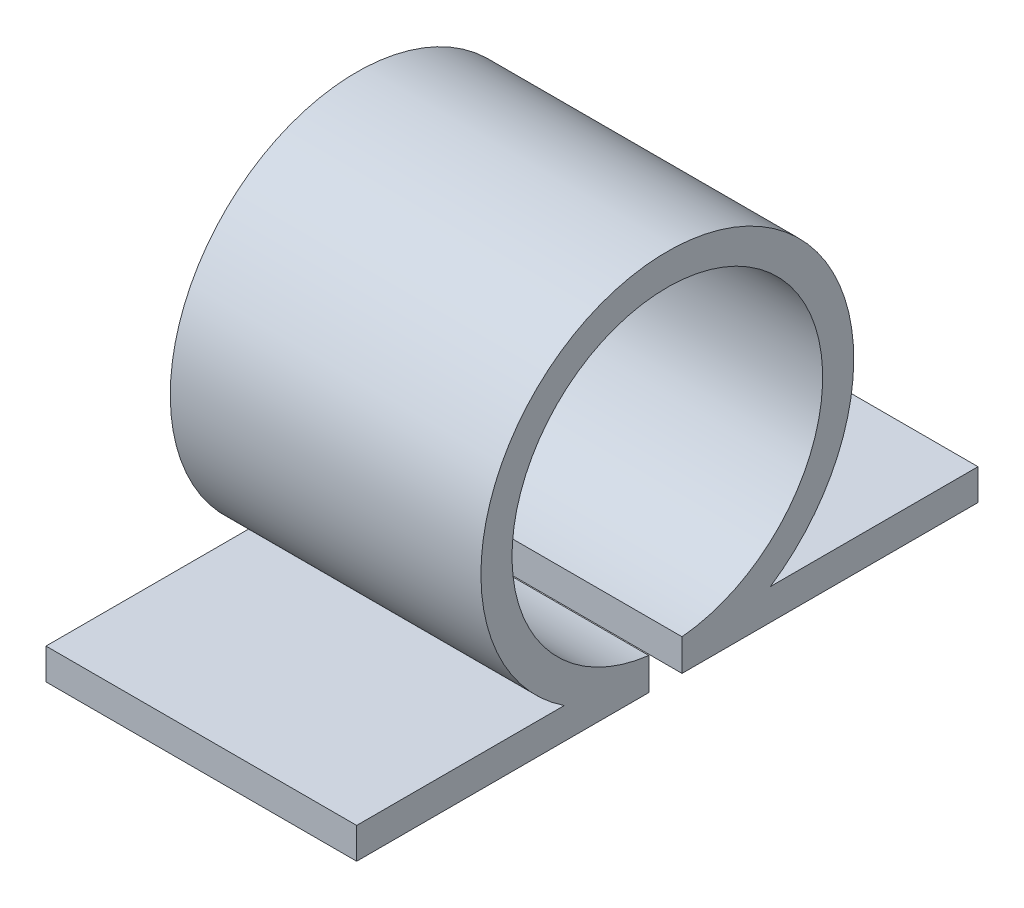
ISO-10303-21;
HEADER;
FILE_DESCRIPTION(('STEP AP214'),'2;1');
FILE_NAME('part.step','',(''),(''),'','','');
FILE_SCHEMA(('AUTOMOTIVE_DESIGN { 1 0 10303 214 1 1 1 1 }'));
ENDSEC;
DATA;
#1=APPLICATION_CONTEXT('core data for automotive mechanical design processes');
#2=APPLICATION_PROTOCOL_DEFINITION('international standard','automotive_design',2000,#1);
#3=PRODUCT_CONTEXT('',#1,'mechanical');
#4=PRODUCT('Part','Part','',(#3));
#5=PRODUCT_RELATED_PRODUCT_CATEGORY('part','',(#4));
#6=PRODUCT_DEFINITION_FORMATION('','',#4);
#7=PRODUCT_DEFINITION_CONTEXT('part definition',#1,'design');
#8=PRODUCT_DEFINITION('design','',#6,#7);
#9=PRODUCT_DEFINITION_SHAPE('','',#8);
#10=(LENGTH_UNIT() NAMED_UNIT(*) SI_UNIT(.MILLI.,.METRE.));
#11=(NAMED_UNIT(*) PLANE_ANGLE_UNIT() SI_UNIT($,.RADIAN.));
#12=(NAMED_UNIT(*) SI_UNIT($,.STERADIAN.) SOLID_ANGLE_UNIT());
#13=UNCERTAINTY_MEASURE_WITH_UNIT(LENGTH_MEASURE(1.E-05),#10,'distance_accuracy_value','');
#14=(GEOMETRIC_REPRESENTATION_CONTEXT(3) GLOBAL_UNCERTAINTY_ASSIGNED_CONTEXT((#13)) GLOBAL_UNIT_ASSIGNED_CONTEXT((#10,
#11,#12)) REPRESENTATION_CONTEXT('',''));
#15=CARTESIAN_POINT('',(0.,0.,0.));
#16=DIRECTION('',(0.,0.,1.));
#17=DIRECTION('',(1.,0.,0.));
#18=AXIS2_PLACEMENT_3D('',#15,#16,#17);
#19=CARTESIAN_POINT('',(10.,0.,0.));
#20=DIRECTION('',(-1.,0.,0.));
#21=DIRECTION('',(0.,0.,1.));
#22=AXIS2_PLACEMENT_3D('',#19,#20,#21);
#23=CYLINDRICAL_SURFACE('',#22,6.);
#24=CARTESIAN_POINT('',(0.,0.,0.));
#25=DIRECTION('',(1.,0.,0.));
#26=DIRECTION('',(0.,0.,-1.));
#27=AXIS2_PLACEMENT_3D('',#24,#25,#26);
#28=CIRCLE('',#27,6.);
#29=CARTESIAN_POINT('',(0.,-5.,-3.3166247903554));
#30=VERTEX_POINT('',#29);
#31=CARTESIAN_POINT('',(0.,-5.,3.3166247903554));
#32=VERTEX_POINT('',#31);
#33=EDGE_CURVE('E139',#30,#32,#28,.T.);
#34=ORIENTED_EDGE('',*,*,#33,.T.);
#35=DIRECTION('',(-1.,0.,0.));
#36=VECTOR('',#35,1.);
#37=CARTESIAN_POINT('',(10.,-5.,3.3166247903554));
#38=LINE('',#37,#36);
#39=CARTESIAN_POINT('',(10.,-5.,3.3166247903554));
#40=VERTEX_POINT('',#39);
#41=EDGE_CURVE('E11',#40,#32,#38,.T.);
#42=ORIENTED_EDGE('',*,*,#41,.F.);
#43=CARTESIAN_POINT('',(10.,0.,0.));
#44=DIRECTION('',(1.,0.,0.));
#45=DIRECTION('',(0.,0.,-1.));
#46=AXIS2_PLACEMENT_3D('',#43,#44,#45);
#47=CIRCLE('',#46,6.);
#48=CARTESIAN_POINT('',(10.,-5.,-3.3166247903554));
#49=VERTEX_POINT('',#48);
#50=EDGE_CURVE('E157',#49,#40,#47,.T.);
#51=ORIENTED_EDGE('',*,*,#50,.F.);
#52=DIRECTION('',(-1.,0.,0.));
#53=VECTOR('',#52,1.);
#54=CARTESIAN_POINT('',(10.,-5.,-3.3166247903554));
#55=LINE('',#54,#53);
#56=EDGE_CURVE('E135',#49,#30,#55,.T.);
#57=ORIENTED_EDGE('',*,*,#56,.T.);
#58=EDGE_LOOP('',(#34,#42,#51,#57));
#59=FACE_BOUND('',#58,.T.);
#60=ADVANCED_FACE('F31',(#59),#23,.T.);
#61=CARTESIAN_POINT('',(10.,-5.,3.3166247903554));
#62=DIRECTION('',(0.,-1.,0.));
#63=DIRECTION('',(0.,0.,-1.));
#64=AXIS2_PLACEMENT_3D('',#61,#62,#63);
#65=PLANE('',#64);
#66=DIRECTION('',(0.,0.,1.));
#67=VECTOR('',#66,1.);
#68=CARTESIAN_POINT('',(0.,-5.,3.3166247903554));
#69=LINE('',#68,#67);
#70=CARTESIAN_POINT('',(0.,-5.,10.));
#71=VERTEX_POINT('',#70);
#72=EDGE_CURVE('E142',#32,#71,#69,.T.);
#73=ORIENTED_EDGE('',*,*,#72,.T.);
#74=DIRECTION('',(-1.,0.,0.));
#75=VECTOR('',#74,1.);
#76=CARTESIAN_POINT('',(10.,-5.,10.));
#77=LINE('',#76,#75);
#78=CARTESIAN_POINT('',(10.,-5.,10.));
#79=VERTEX_POINT('',#78);
#80=EDGE_CURVE('E39',#79,#71,#77,.T.);
#81=ORIENTED_EDGE('',*,*,#80,.F.);
#82=DIRECTION('',(0.,0.,1.));
#83=VECTOR('',#82,1.);
#84=CARTESIAN_POINT('',(10.,-5.,3.3166247903554));
#85=LINE('',#84,#83);
#86=EDGE_CURVE('E96',#40,#79,#85,.T.);
#87=ORIENTED_EDGE('',*,*,#86,.F.);
#88=ORIENTED_EDGE('',*,*,#41,.T.);
#89=EDGE_LOOP('',(#73,#81,#87,#88));
#90=FACE_BOUND('',#89,.T.);
#91=ADVANCED_FACE('F206',(#90),#65,.F.);
#92=CARTESIAN_POINT('',(10.,-5.,10.));
#93=DIRECTION('',(0.,0.,-1.));
#94=DIRECTION('',(-1.,0.,0.));
#95=AXIS2_PLACEMENT_3D('',#92,#93,#94);
#96=PLANE('',#95);
#97=DIRECTION('',(0.,-1.,0.));
#98=VECTOR('',#97,1.);
#99=CARTESIAN_POINT('',(0.,-5.,10.));
#100=LINE('',#99,#98);
#101=CARTESIAN_POINT('',(0.,-6.,10.));
#102=VERTEX_POINT('',#101);
#103=EDGE_CURVE('E144',#71,#102,#100,.T.);
#104=ORIENTED_EDGE('',*,*,#103,.T.);
#105=DIRECTION('',(-1.,0.,0.));
#106=VECTOR('',#105,1.);
#107=CARTESIAN_POINT('',(10.,-6.,10.));
#108=LINE('',#107,#106);
#109=CARTESIAN_POINT('',(10.,-6.,10.));
#110=VERTEX_POINT('',#109);
#111=EDGE_CURVE('E170',#110,#102,#108,.T.);
#112=ORIENTED_EDGE('',*,*,#111,.F.);
#113=DIRECTION('',(0.,-1.,0.));
#114=VECTOR('',#113,1.);
#115=CARTESIAN_POINT('',(10.,-5.,10.));
#116=LINE('',#115,#114);
#117=EDGE_CURVE('E178',#79,#110,#116,.T.);
#118=ORIENTED_EDGE('',*,*,#117,.F.);
#119=ORIENTED_EDGE('',*,*,#80,.T.);
#120=EDGE_LOOP('',(#104,#112,#118,#119));
#121=FACE_BOUND('',#120,.T.);
#122=ADVANCED_FACE('F176',(#121),#96,.F.);
#123=CARTESIAN_POINT('',(10.,-6.,10.));
#124=DIRECTION('',(0.,1.,0.));
#125=DIRECTION('',(0.,0.,1.));
#126=AXIS2_PLACEMENT_3D('',#123,#124,#125);
#127=PLANE('',#126);
#128=DIRECTION('',(0.,0.,-1.));
#129=VECTOR('',#128,1.);
#130=CARTESIAN_POINT('',(0.,-6.,10.));
#131=LINE('',#130,#129);
#132=CARTESIAN_POINT('',(0.,-6.,0.597061760999922));
#133=VERTEX_POINT('',#132);
#134=EDGE_CURVE('E146',#102,#133,#131,.T.);
#135=ORIENTED_EDGE('',*,*,#134,.T.);
#136=DIRECTION('',(-1.,0.,0.));
#137=VECTOR('',#136,1.);
#138=CARTESIAN_POINT('',(10.,-6.,0.597061760999922));
#139=LINE('',#138,#137);
#140=CARTESIAN_POINT('',(10.,-6.,0.597061760999922));
#141=VERTEX_POINT('',#140);
#142=EDGE_CURVE('E167',#141,#133,#139,.T.);
#143=ORIENTED_EDGE('',*,*,#142,.F.);
#144=DIRECTION('',(0.,0.,-1.));
#145=VECTOR('',#144,1.);
#146=CARTESIAN_POINT('',(10.,-6.,10.));
#147=LINE('',#146,#145);
#148=EDGE_CURVE('E196',#110,#141,#147,.T.);
#149=ORIENTED_EDGE('',*,*,#148,.F.);
#150=ORIENTED_EDGE('',*,*,#111,.T.);
#151=EDGE_LOOP('',(#135,#143,#149,#150));
#152=FACE_BOUND('',#151,.T.);
#153=ADVANCED_FACE('F187',(#152),#127,.F.);
#154=CARTESIAN_POINT('',(10.,-6.,0.597061760999922));
#155=DIRECTION('',(0.,0.,1.));
#156=DIRECTION('',(1.,0.,0.));
#157=AXIS2_PLACEMENT_3D('',#154,#155,#156);
#158=PLANE('',#157);
#159=DIRECTION('',(0.,1.,0.));
#160=VECTOR('',#159,1.);
#161=CARTESIAN_POINT('',(0.,-6.,0.597061760999922));
#162=LINE('',#161,#160);
#163=CARTESIAN_POINT('',(0.,-4.96422373121434,0.597061760999924));
#164=VERTEX_POINT('',#163);
#165=EDGE_CURVE('E148',#133,#164,#162,.T.);
#166=ORIENTED_EDGE('',*,*,#165,.T.);
#167=DIRECTION('',(-1.,0.,0.));
#168=VECTOR('',#167,1.);
#169=CARTESIAN_POINT('',(10.,-4.96422373121434,0.597061760999924));
#170=LINE('',#169,#168);
#171=CARTESIAN_POINT('',(10.,-4.96422373121434,0.597061760999924));
#172=VERTEX_POINT('',#171);
#173=EDGE_CURVE('E164',#172,#164,#170,.T.);
#174=ORIENTED_EDGE('',*,*,#173,.F.);
#175=DIRECTION('',(0.,1.,0.));
#176=VECTOR('',#175,1.);
#177=CARTESIAN_POINT('',(10.,-6.,0.597061760999922));
#178=LINE('',#177,#176);
#179=EDGE_CURVE('E193',#141,#172,#178,.T.);
#180=ORIENTED_EDGE('',*,*,#179,.F.);
#181=ORIENTED_EDGE('',*,*,#142,.T.);
#182=EDGE_LOOP('',(#166,#174,#180,#181));
#183=FACE_BOUND('',#182,.T.);
#184=ADVANCED_FACE('F191',(#183),#158,.F.);
#185=CARTESIAN_POINT('',(10.,0.,0.));
#186=DIRECTION('',(-1.,0.,0.));
#187=DIRECTION('',(0.,0.,1.));
#188=AXIS2_PLACEMENT_3D('',#185,#186,#187);
#189=CYLINDRICAL_SURFACE('',#188,5.);
#190=CARTESIAN_POINT('',(0.,0.,0.));
#191=DIRECTION('',(-1.,0.,0.));
#192=DIRECTION('',(0.,0.,-1.));
#193=AXIS2_PLACEMENT_3D('',#190,#191,#192);
#194=CIRCLE('',#193,5.);
#195=CARTESIAN_POINT('',(0.,-4.97757722308423,-0.47299575921263));
#196=VERTEX_POINT('',#195);
#197=EDGE_CURVE('E150',#164,#196,#194,.T.);
#198=ORIENTED_EDGE('',*,*,#197,.T.);
#199=DIRECTION('',(-1.,0.,0.));
#200=VECTOR('',#199,1.);
#201=CARTESIAN_POINT('',(10.,-4.97757722308423,-0.47299575921263));
#202=LINE('',#201,#200);
#203=CARTESIAN_POINT('',(10.,-4.97757722308423,-0.47299575921263));
#204=VERTEX_POINT('',#203);
#205=EDGE_CURVE('E161',#204,#196,#202,.T.);
#206=ORIENTED_EDGE('',*,*,#205,.F.);
#207=CARTESIAN_POINT('',(10.,0.,0.));
#208=DIRECTION('',(-1.,0.,0.));
#209=DIRECTION('',(0.,0.,-1.));
#210=AXIS2_PLACEMENT_3D('',#207,#208,#209);
#211=CIRCLE('',#210,5.);
#212=EDGE_CURVE('E195',#172,#204,#211,.T.);
#213=ORIENTED_EDGE('',*,*,#212,.F.);
#214=ORIENTED_EDGE('',*,*,#173,.T.);
#215=EDGE_LOOP('',(#198,#206,#213,#214));
#216=FACE_BOUND('',#215,.T.);
#217=ADVANCED_FACE('F218',(#216),#189,.F.);
#218=CARTESIAN_POINT('',(10.,-6.,-0.472995759212629));
#219=DIRECTION('',(0.,0.,-1.));
#220=DIRECTION('',(0.,1.,0.));
#221=AXIS2_PLACEMENT_3D('',#218,#219,#220);
#222=PLANE('',#221);
#223=DIRECTION('',(0.,-1.,0.));
#224=VECTOR('',#223,1.);
#225=CARTESIAN_POINT('',(0.,-6.,-0.472995759212629));
#226=LINE('',#225,#224);
#227=CARTESIAN_POINT('',(0.,-6.,-0.472995759212629));
#228=VERTEX_POINT('',#227);
#229=EDGE_CURVE('E152',#196,#228,#226,.T.);
#230=ORIENTED_EDGE('',*,*,#229,.T.);
#231=DIRECTION('',(-1.,0.,0.));
#232=VECTOR('',#231,1.);
#233=CARTESIAN_POINT('',(10.,-6.,-0.472995759212629));
#234=LINE('',#233,#232);
#235=CARTESIAN_POINT('',(10.,-6.,-0.472995759212629));
#236=VERTEX_POINT('',#235);
#237=EDGE_CURVE('E130',#236,#228,#234,.T.);
#238=ORIENTED_EDGE('',*,*,#237,.F.);
#239=DIRECTION('',(0.,-1.,0.));
#240=VECTOR('',#239,1.);
#241=CARTESIAN_POINT('',(10.,-6.,-0.472995759212629));
#242=LINE('',#241,#240);
#243=EDGE_CURVE('E121',#204,#236,#242,.T.);
#244=ORIENTED_EDGE('',*,*,#243,.F.);
#245=ORIENTED_EDGE('',*,*,#205,.T.);
#246=EDGE_LOOP('',(#230,#238,#244,#245));
#247=FACE_BOUND('',#246,.T.);
#248=ADVANCED_FACE('F221',(#247),#222,.F.);
#249=CARTESIAN_POINT('',(10.,-6.,-10.));
#250=DIRECTION('',(0.,1.,0.));
#251=DIRECTION('',(0.,0.,1.));
#252=AXIS2_PLACEMENT_3D('',#249,#250,#251);
#253=PLANE('',#252);
#254=DIRECTION('',(0.,0.,-1.));
#255=VECTOR('',#254,1.);
#256=CARTESIAN_POINT('',(0.,-6.,-10.));
#257=LINE('',#256,#255);
#258=CARTESIAN_POINT('',(0.,-6.,-10.));
#259=VERTEX_POINT('',#258);
#260=EDGE_CURVE('E129',#228,#259,#257,.T.);
#261=ORIENTED_EDGE('',*,*,#260,.T.);
#262=DIRECTION('',(-1.,0.,0.));
#263=VECTOR('',#262,1.);
#264=CARTESIAN_POINT('',(10.,-6.,-10.));
#265=LINE('',#264,#263);
#266=CARTESIAN_POINT('',(10.,-6.,-10.));
#267=VERTEX_POINT('',#266);
#268=EDGE_CURVE('E126',#267,#259,#265,.T.);
#269=ORIENTED_EDGE('',*,*,#268,.F.);
#270=DIRECTION('',(0.,0.,-1.));
#271=VECTOR('',#270,1.);
#272=CARTESIAN_POINT('',(10.,-6.,-10.));
#273=LINE('',#272,#271);
#274=EDGE_CURVE('E115',#236,#267,#273,.T.);
#275=ORIENTED_EDGE('',*,*,#274,.F.);
#276=ORIENTED_EDGE('',*,*,#237,.T.);
#277=EDGE_LOOP('',(#261,#269,#275,#276));
#278=FACE_BOUND('',#277,.T.);
#279=ADVANCED_FACE('F127',(#278),#253,.F.);
#280=CARTESIAN_POINT('',(10.,-5.,-10.));
#281=DIRECTION('',(0.,0.,1.));
#282=DIRECTION('',(1.,0.,0.));
#283=AXIS2_PLACEMENT_3D('',#280,#281,#282);
#284=PLANE('',#283);
#285=DIRECTION('',(0.,1.,0.));
#286=VECTOR('',#285,1.);
#287=CARTESIAN_POINT('',(0.,-5.,-10.));
#288=LINE('',#287,#286);
#289=CARTESIAN_POINT('',(0.,-5.,-10.));
#290=VERTEX_POINT('',#289);
#291=EDGE_CURVE('E82',#259,#290,#288,.T.);
#292=ORIENTED_EDGE('',*,*,#291,.T.);
#293=DIRECTION('',(-1.,0.,0.));
#294=VECTOR('',#293,1.);
#295=CARTESIAN_POINT('',(10.,-5.,-10.));
#296=LINE('',#295,#294);
#297=CARTESIAN_POINT('',(10.,-5.,-10.));
#298=VERTEX_POINT('',#297);
#299=EDGE_CURVE('E131',#298,#290,#296,.T.);
#300=ORIENTED_EDGE('',*,*,#299,.F.);
#301=DIRECTION('',(0.,1.,0.));
#302=VECTOR('',#301,1.);
#303=CARTESIAN_POINT('',(10.,-5.,-10.));
#304=LINE('',#303,#302);
#305=EDGE_CURVE('E119',#267,#298,#304,.T.);
#306=ORIENTED_EDGE('',*,*,#305,.F.);
#307=ORIENTED_EDGE('',*,*,#268,.T.);
#308=EDGE_LOOP('',(#292,#300,#306,#307));
#309=FACE_BOUND('',#308,.T.);
#310=ADVANCED_FACE('F133',(#309),#284,.F.);
#311=CARTESIAN_POINT('',(10.,-5.,-10.));
#312=DIRECTION('',(0.,-1.,0.));
#313=DIRECTION('',(0.,0.,-1.));
#314=AXIS2_PLACEMENT_3D('',#311,#312,#313);
#315=PLANE('',#314);
#316=DIRECTION('',(0.,0.,1.));
#317=VECTOR('',#316,1.);
#318=CARTESIAN_POINT('',(0.,-5.,-10.));
#319=LINE('',#318,#317);
#320=EDGE_CURVE('E88',#290,#30,#319,.T.);
#321=ORIENTED_EDGE('',*,*,#320,.T.);
#322=ORIENTED_EDGE('',*,*,#56,.F.);
#323=DIRECTION('',(0.,0.,1.));
#324=VECTOR('',#323,1.);
#325=CARTESIAN_POINT('',(10.,-5.,-10.));
#326=LINE('',#325,#324);
#327=EDGE_CURVE('E47',#298,#49,#326,.T.);
#328=ORIENTED_EDGE('',*,*,#327,.F.);
#329=ORIENTED_EDGE('',*,*,#299,.T.);
#330=EDGE_LOOP('',(#321,#322,#328,#329));
#331=FACE_BOUND('',#330,.T.);
#332=ADVANCED_FACE('F230',(#331),#315,.F.);
#333=CARTESIAN_POINT('',(10.,0.,0.));
#334=DIRECTION('',(1.,0.,0.));
#335=DIRECTION('',(0.,0.,-1.));
#336=AXIS2_PLACEMENT_3D('',#333,#334,#335);
#337=PLANE('',#336);
#338=ORIENTED_EDGE('',*,*,#50,.T.);
#339=ORIENTED_EDGE('',*,*,#86,.T.);
#340=ORIENTED_EDGE('',*,*,#117,.T.);
#341=ORIENTED_EDGE('',*,*,#148,.T.);
#342=ORIENTED_EDGE('',*,*,#179,.T.);
#343=ORIENTED_EDGE('',*,*,#212,.T.);
#344=ORIENTED_EDGE('',*,*,#243,.T.);
#345=ORIENTED_EDGE('',*,*,#274,.T.);
#346=ORIENTED_EDGE('',*,*,#305,.T.);
#347=ORIENTED_EDGE('',*,*,#327,.T.);
#348=EDGE_LOOP('',(#338,#339,#340,#341,#342,#343,#344,#345,#346,#347));
#349=FACE_BOUND('',#348,.T.);
#350=ADVANCED_FACE('F117',(#349),#337,.T.);
#351=CARTESIAN_POINT('',(0.,0.,0.));
#352=DIRECTION('',(1.,0.,0.));
#353=DIRECTION('',(0.,0.,-1.));
#354=AXIS2_PLACEMENT_3D('',#351,#352,#353);
#355=PLANE('',#354);
#356=ORIENTED_EDGE('',*,*,#33,.F.);
#357=ORIENTED_EDGE('',*,*,#320,.F.);
#358=ORIENTED_EDGE('',*,*,#291,.F.);
#359=ORIENTED_EDGE('',*,*,#260,.F.);
#360=ORIENTED_EDGE('',*,*,#229,.F.);
#361=ORIENTED_EDGE('',*,*,#197,.F.);
#362=ORIENTED_EDGE('',*,*,#165,.F.);
#363=ORIENTED_EDGE('',*,*,#134,.F.);
#364=ORIENTED_EDGE('',*,*,#103,.F.);
#365=ORIENTED_EDGE('',*,*,#72,.F.);
#366=EDGE_LOOP('',(#356,#357,#358,#359,#360,#361,#362,#363,#364,#365));
#367=FACE_BOUND('',#366,.T.);
#368=ADVANCED_FACE('F182',(#367),#355,.F.);
#369=CLOSED_SHELL('',(#60,#91,#122,#153,#184,#217,#248,#279,#310,#332,#350,#368));
#370=MANIFOLD_SOLID_BREP('B2',#369);
#371=ADVANCED_BREP_SHAPE_REPRESENTATION('',(#18,#370),#14);
#372=SHAPE_DEFINITION_REPRESENTATION(#9,#371);
ENDSEC;
END-ISO-10303-21;
